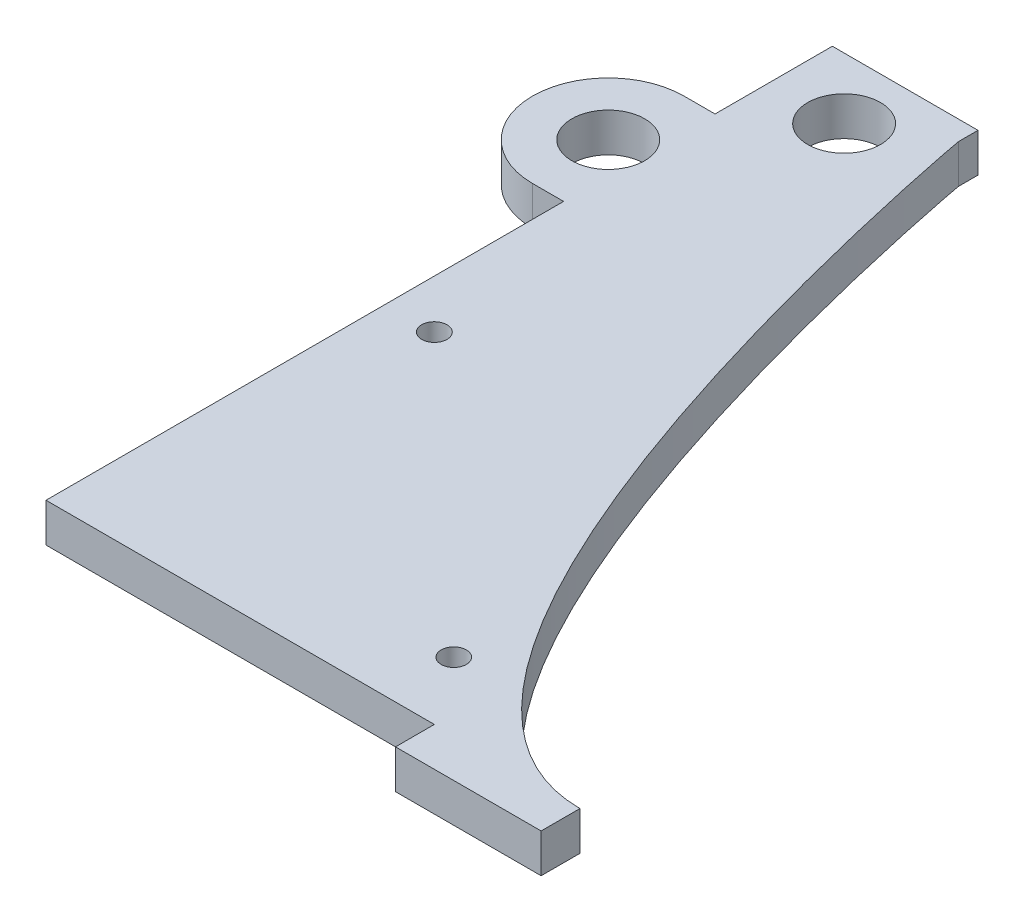
ISO-10303-21;
HEADER;
FILE_DESCRIPTION(('STEP AP214'),'2;1');
FILE_NAME('part.step','',(''),(''),'','','');
FILE_SCHEMA(('AUTOMOTIVE_DESIGN { 1 0 10303 214 1 1 1 1 }'));
ENDSEC;
DATA;
#1=APPLICATION_CONTEXT('core data for automotive mechanical design processes');
#2=APPLICATION_PROTOCOL_DEFINITION('international standard','automotive_design',2000,#1);
#3=PRODUCT_CONTEXT('',#1,'mechanical');
#4=PRODUCT('Part','Part','',(#3));
#5=PRODUCT_RELATED_PRODUCT_CATEGORY('part','',(#4));
#6=PRODUCT_DEFINITION_FORMATION('','',#4);
#7=PRODUCT_DEFINITION_CONTEXT('part definition',#1,'design');
#8=PRODUCT_DEFINITION('design','',#6,#7);
#9=PRODUCT_DEFINITION_SHAPE('','',#8);
#10=(LENGTH_UNIT() NAMED_UNIT(*) SI_UNIT(.MILLI.,.METRE.));
#11=(NAMED_UNIT(*) PLANE_ANGLE_UNIT() SI_UNIT($,.RADIAN.));
#12=(NAMED_UNIT(*) SI_UNIT($,.STERADIAN.) SOLID_ANGLE_UNIT());
#13=UNCERTAINTY_MEASURE_WITH_UNIT(LENGTH_MEASURE(1.E-05),#10,'distance_accuracy_value','');
#14=(GEOMETRIC_REPRESENTATION_CONTEXT(3) GLOBAL_UNCERTAINTY_ASSIGNED_CONTEXT((#13)) GLOBAL_UNIT_ASSIGNED_CONTEXT((#10,
#11,#12)) REPRESENTATION_CONTEXT('',''));
#15=CARTESIAN_POINT('',(0.,0.,0.));
#16=DIRECTION('',(0.,0.,1.));
#17=DIRECTION('',(1.,0.,0.));
#18=AXIS2_PLACEMENT_3D('',#15,#16,#17);
#19=CARTESIAN_POINT('',(-9.525,5.08,48.8950000000001));
#20=DIRECTION('',(1.,0.,0.));
#21=DIRECTION('',(0.,0.,-1.));
#22=AXIS2_PLACEMENT_3D('',#19,#20,#21);
#23=PLANE('',#22);
#24=DIRECTION('',(0.,0.,1.));
#25=VECTOR('',#24,1.);
#26=CARTESIAN_POINT('',(-9.525,5.08,48.8950000000001));
#27=LINE('',#26,#25);
#28=CARTESIAN_POINT('',(-9.52499999999999,5.08,-18.8143243895907));
#29=VERTEX_POINT('',#28);
#30=CARTESIAN_POINT('',(-9.525,5.08,48.8950000000001));
#31=VERTEX_POINT('',#30);
#32=EDGE_CURVE('E59',#29,#31,#27,.T.);
#33=ORIENTED_EDGE('',*,*,#32,.F.);
#34=DIRECTION('',(0.,-1.,0.));
#35=VECTOR('',#34,1.);
#36=CARTESIAN_POINT('',(-9.52499999999999,5.08,-18.8143243895907));
#37=LINE('',#36,#35);
#38=CARTESIAN_POINT('',(-9.52499999999999,0.,-18.8143243895907));
#39=VERTEX_POINT('',#38);
#40=EDGE_CURVE('E180',#29,#39,#37,.T.);
#41=ORIENTED_EDGE('',*,*,#40,.T.);
#42=DIRECTION('',(0.,0.,1.));
#43=VECTOR('',#42,1.);
#44=CARTESIAN_POINT('',(-9.525,0.,48.8950000000001));
#45=LINE('',#44,#43);
#46=CARTESIAN_POINT('',(-9.525,0.,48.8950000000001));
#47=VERTEX_POINT('',#46);
#48=EDGE_CURVE('E354',#39,#47,#45,.T.);
#49=ORIENTED_EDGE('',*,*,#48,.T.);
#50=DIRECTION('',(0.,-1.,0.));
#51=VECTOR('',#50,1.);
#52=CARTESIAN_POINT('',(-9.525,5.08,48.8950000000001));
#53=LINE('',#52,#51);
#54=EDGE_CURVE('E389',#31,#47,#53,.T.);
#55=ORIENTED_EDGE('',*,*,#54,.F.);
#56=EDGE_LOOP('',(#33,#41,#49,#55));
#57=FACE_BOUND('',#56,.T.);
#58=ADVANCED_FACE('F43',(#57),#23,.F.);
#59=CARTESIAN_POINT('',(22.7352910938507,5.08,-1.18732961513015));
#60=DIRECTION('',(0.,-1.,0.));
#61=DIRECTION('',(0.,0.,-1.));
#62=AXIS2_PLACEMENT_3D('',#59,#60,#61);
#63=PLANE('',#62);
#64=DIRECTION('',(-1.,0.,0.));
#65=VECTOR('',#64,1.);
#66=CARTESIAN_POINT('',(-13.589,5.08,-18.8143243895907));
#67=LINE('',#66,#65);
#68=CARTESIAN_POINT('',(-13.589,5.08,-18.8143243895907));
#69=VERTEX_POINT('',#68);
#70=EDGE_CURVE('E145',#29,#69,#67,.T.);
#71=ORIENTED_EDGE('',*,*,#70,.F.);
#72=ORIENTED_EDGE('',*,*,#32,.T.);
#73=DIRECTION('',(1.,0.,0.));
#74=VECTOR('',#73,1.);
#75=CARTESIAN_POINT('',(60.325,5.08,48.8950000000001));
#76=LINE('',#75,#74);
#77=CARTESIAN_POINT('',(41.275,5.08,48.8950000000001));
#78=VERTEX_POINT('',#77);
#79=EDGE_CURVE('E252',#31,#78,#76,.T.);
#80=ORIENTED_EDGE('',*,*,#79,.T.);
#81=DIRECTION('',(0.,0.,1.));
#82=VECTOR('',#81,1.);
#83=CARTESIAN_POINT('',(41.275,5.08,48.8950000000001));
#84=LINE('',#83,#82);
#85=CARTESIAN_POINT('',(41.275,5.08,53.9750000000001));
#86=VERTEX_POINT('',#85);
#87=EDGE_CURVE('E206',#78,#86,#84,.T.);
#88=ORIENTED_EDGE('',*,*,#87,.T.);
#89=DIRECTION('',(1.,0.,0.));
#90=VECTOR('',#89,1.);
#91=CARTESIAN_POINT('',(60.325,5.08,53.9750000000001));
#92=LINE('',#91,#90);
#93=CARTESIAN_POINT('',(60.325,5.08,53.9750000000001));
#94=VERTEX_POINT('',#93);
#95=EDGE_CURVE('E201',#86,#94,#92,.T.);
#96=ORIENTED_EDGE('',*,*,#95,.T.);
#97=DIRECTION('',(0.,0.,-1.));
#98=VECTOR('',#97,1.);
#99=CARTESIAN_POINT('',(60.325,5.08,48.8950000000001));
#100=LINE('',#99,#98);
#101=CARTESIAN_POINT('',(60.325,5.08,48.8950000000001));
#102=VERTEX_POINT('',#101);
#103=EDGE_CURVE('E189',#94,#102,#100,.T.);
#104=ORIENTED_EDGE('',*,*,#103,.T.);
#105=CARTESIAN_POINT('',(60.325,5.08,48.895));
#106=CARTESIAN_POINT('',(27.8191095836019,5.08,48.895));
#107=CARTESIAN_POINT('',(9.525,5.08,-51.214545640347));
#108=CARTESIAN_POINT('',(9.525,5.08,-51.435));
#109=B_SPLINE_CURVE_WITH_KNOTS('',3,(#105,#106,#107,#108),.UNSPECIFIED.,.F.,.F.,(4,4),(0.,1.),.UNSPECIFIED.);
#110=CARTESIAN_POINT('',(9.525,5.08,-51.435));
#111=VERTEX_POINT('',#110);
#112=EDGE_CURVE('E256',#102,#111,#109,.T.);
#113=ORIENTED_EDGE('',*,*,#112,.T.);
#114=DIRECTION('',(0.,0.,-1.));
#115=VECTOR('',#114,1.);
#116=CARTESIAN_POINT('',(9.525,5.08,-51.435));
#117=LINE('',#116,#115);
#118=CARTESIAN_POINT('',(9.52499999999999,5.08,-53.9749999999999));
#119=VERTEX_POINT('',#118);
#120=EDGE_CURVE('E242',#111,#119,#117,.T.);
#121=ORIENTED_EDGE('',*,*,#120,.T.);
#122=DIRECTION('',(-1.,0.,0.));
#123=VECTOR('',#122,1.);
#124=CARTESIAN_POINT('',(-9.52499999999998,5.08,-53.9749999999999));
#125=LINE('',#124,#123);
#126=CARTESIAN_POINT('',(-9.52499999999998,5.08,-53.9749999999999));
#127=VERTEX_POINT('',#126);
#128=EDGE_CURVE('E246',#119,#127,#125,.T.);
#129=ORIENTED_EDGE('',*,*,#128,.T.);
#130=CARTESIAN_POINT('',(-9.52499999999999,5.08,-38.6263243895907));
#131=VERTEX_POINT('',#130);
#132=EDGE_CURVE('E154',#127,#131,#27,.T.);
#133=ORIENTED_EDGE('',*,*,#132,.T.);
#134=DIRECTION('',(1.,0.,0.));
#135=VECTOR('',#134,1.);
#136=CARTESIAN_POINT('',(-13.589,5.08,-38.6263243895907));
#137=LINE('',#136,#135);
#138=CARTESIAN_POINT('',(-13.589,5.08,-38.6263243895907));
#139=VERTEX_POINT('',#138);
#140=EDGE_CURVE('E137',#139,#131,#137,.T.);
#141=ORIENTED_EDGE('',*,*,#140,.F.);
#142=CARTESIAN_POINT('',(-13.589,5.08,-28.7203243895907));
#143=DIRECTION('',(0.,-1.,0.));
#144=DIRECTION('',(0.,0.,-1.));
#145=AXIS2_PLACEMENT_3D('',#142,#143,#144);
#146=CIRCLE('',#145,9.906);
#147=EDGE_CURVE('E152',#69,#139,#146,.T.);
#148=ORIENTED_EDGE('',*,*,#147,.F.);
#149=EDGE_LOOP('',(#71,#72,#80,#88,#96,#104,#113,#121,#129,#133,#141,#148));
#150=FACE_BOUND('',#149,.T.);
#151=CARTESIAN_POINT('',(34.925,5.08,40.0050000000001));
#152=DIRECTION('',(0.,-1.,0.));
#153=DIRECTION('',(0.,0.,-1.));
#154=AXIS2_PLACEMENT_3D('',#151,#152,#153);
#155=CIRCLE('',#154,1.651);
#156=CARTESIAN_POINT('',(34.925,5.08,38.3540000000001));
#157=VERTEX_POINT('',#156);
#158=EDGE_CURVE('E185',#157,#157,#155,.T.);
#159=ORIENTED_EDGE('',*,*,#158,.T.);
#160=EDGE_LOOP('',(#159));
#161=FACE_BOUND('',#160,.T.);
#162=CARTESIAN_POINT('',(-3.17499999999998,5.08,4.44500000000005));
#163=DIRECTION('',(0.,-1.,0.));
#164=DIRECTION('',(0.,0.,-1.));
#165=AXIS2_PLACEMENT_3D('',#162,#163,#164);
#166=CIRCLE('',#165,1.66072838208594);
#167=CARTESIAN_POINT('',(-3.17499999999998,5.08,2.78427161791411));
#168=VERTEX_POINT('',#167);
#169=EDGE_CURVE('E179',#168,#168,#166,.T.);
#170=ORIENTED_EDGE('',*,*,#169,.T.);
#171=EDGE_LOOP('',(#170));
#172=FACE_BOUND('',#171,.T.);
#173=CARTESIAN_POINT('',(-13.589,5.08,-28.7203243895907));
#174=DIRECTION('',(0.,-1.,0.));
#175=DIRECTION('',(0.,0.,-1.));
#176=AXIS2_PLACEMENT_3D('',#173,#174,#175);
#177=CIRCLE('',#176,4.7625);
#178=CARTESIAN_POINT('',(-13.589,5.08,-33.4828243895907));
#179=VERTEX_POINT('',#178);
#180=EDGE_CURVE('E174',#179,#179,#177,.T.);
#181=ORIENTED_EDGE('',*,*,#180,.T.);
#182=EDGE_LOOP('',(#181));
#183=FACE_BOUND('',#182,.T.);
#184=CARTESIAN_POINT('',(0.,5.08,-45.9866999999999));
#185=DIRECTION('',(0.,1.,0.));
#186=DIRECTION('',(0.,0.,1.));
#187=AXIS2_PLACEMENT_3D('',#184,#185,#186);
#188=CIRCLE('',#187,4.7625);
#189=CARTESIAN_POINT('',(0.,5.08,-41.2241999999999));
#190=VERTEX_POINT('',#189);
#191=EDGE_CURVE('E234',#190,#190,#188,.T.);
#192=ORIENTED_EDGE('',*,*,#191,.F.);
#193=EDGE_LOOP('',(#192));
#194=FACE_BOUND('',#193,.T.);
#195=ADVANCED_FACE('F150',(#150,#161,#172,#183,#194),#63,.F.);
#196=CARTESIAN_POINT('',(22.7352910938507,0.,-1.18732961513015));
#197=DIRECTION('',(0.,-1.,0.));
#198=DIRECTION('',(0.,0.,-1.));
#199=AXIS2_PLACEMENT_3D('',#196,#197,#198);
#200=PLANE('',#199);
#201=CARTESIAN_POINT('',(-13.589,0.,-28.7203243895907));
#202=DIRECTION('',(0.,-1.,0.));
#203=DIRECTION('',(0.,0.,-1.));
#204=AXIS2_PLACEMENT_3D('',#201,#202,#203);
#205=CIRCLE('',#204,4.7625);
#206=CARTESIAN_POINT('',(-13.589,0.,-33.4828243895907));
#207=VERTEX_POINT('',#206);
#208=EDGE_CURVE('E166',#207,#207,#205,.T.);
#209=ORIENTED_EDGE('',*,*,#208,.F.);
#210=EDGE_LOOP('',(#209));
#211=FACE_BOUND('',#210,.T.);
#212=ORIENTED_EDGE('',*,*,#48,.F.);
#213=DIRECTION('',(-1.,0.,0.));
#214=VECTOR('',#213,1.);
#215=CARTESIAN_POINT('',(-13.589,0.,-18.8143243895907));
#216=LINE('',#215,#214);
#217=CARTESIAN_POINT('',(-13.589,0.,-18.8143243895907));
#218=VERTEX_POINT('',#217);
#219=EDGE_CURVE('E160',#39,#218,#216,.T.);
#220=ORIENTED_EDGE('',*,*,#219,.T.);
#221=CARTESIAN_POINT('',(-13.589,0.,-28.7203243895907));
#222=DIRECTION('',(0.,-1.,0.));
#223=DIRECTION('',(0.,0.,-1.));
#224=AXIS2_PLACEMENT_3D('',#221,#222,#223);
#225=CIRCLE('',#224,9.906);
#226=CARTESIAN_POINT('',(-13.589,0.,-38.6263243895907));
#227=VERTEX_POINT('',#226);
#228=EDGE_CURVE('E171',#218,#227,#225,.T.);
#229=ORIENTED_EDGE('',*,*,#228,.T.);
#230=DIRECTION('',(1.,0.,0.));
#231=VECTOR('',#230,1.);
#232=CARTESIAN_POINT('',(-13.589,0.,-38.6263243895907));
#233=LINE('',#232,#231);
#234=CARTESIAN_POINT('',(-9.52499999999999,0.,-38.6263243895907));
#235=VERTEX_POINT('',#234);
#236=EDGE_CURVE('E139',#227,#235,#233,.T.);
#237=ORIENTED_EDGE('',*,*,#236,.T.);
#238=CARTESIAN_POINT('',(-9.52499999999998,0.,-53.9749999999999));
#239=VERTEX_POINT('',#238);
#240=EDGE_CURVE('E365',#239,#235,#45,.T.);
#241=ORIENTED_EDGE('',*,*,#240,.F.);
#242=DIRECTION('',(-1.,0.,0.));
#243=VECTOR('',#242,1.);
#244=CARTESIAN_POINT('',(-9.52499999999998,0.,-53.9749999999999));
#245=LINE('',#244,#243);
#246=CARTESIAN_POINT('',(9.52499999999999,0.,-53.9749999999999));
#247=VERTEX_POINT('',#246);
#248=EDGE_CURVE('E366',#247,#239,#245,.T.);
#249=ORIENTED_EDGE('',*,*,#248,.F.);
#250=DIRECTION('',(0.,0.,-1.));
#251=VECTOR('',#250,1.);
#252=CARTESIAN_POINT('',(9.525,0.,-51.435));
#253=LINE('',#252,#251);
#254=CARTESIAN_POINT('',(9.525,0.,-51.435));
#255=VERTEX_POINT('',#254);
#256=EDGE_CURVE('E238',#255,#247,#253,.T.);
#257=ORIENTED_EDGE('',*,*,#256,.F.);
#258=CARTESIAN_POINT('',(60.325,0.,48.895));
#259=CARTESIAN_POINT('',(27.8191095836019,0.,48.895));
#260=CARTESIAN_POINT('',(9.525,0.,-51.214545640347));
#261=CARTESIAN_POINT('',(9.525,0.,-51.435));
#262=B_SPLINE_CURVE_WITH_KNOTS('',3,(#258,#259,#260,#261),.UNSPECIFIED.,.F.,.F.,(4,4),(0.,1.),.UNSPECIFIED.);
#263=CARTESIAN_POINT('',(60.325,0.,48.8950000000001));
#264=VERTEX_POINT('',#263);
#265=EDGE_CURVE('E247',#264,#255,#262,.T.);
#266=ORIENTED_EDGE('',*,*,#265,.F.);
#267=DIRECTION('',(0.,0.,-1.));
#268=VECTOR('',#267,1.);
#269=CARTESIAN_POINT('',(60.325,0.,48.8950000000001));
#270=LINE('',#269,#268);
#271=CARTESIAN_POINT('',(60.325,0.,53.9750000000001));
#272=VERTEX_POINT('',#271);
#273=EDGE_CURVE('E213',#272,#264,#270,.T.);
#274=ORIENTED_EDGE('',*,*,#273,.F.);
#275=DIRECTION('',(1.,0.,0.));
#276=VECTOR('',#275,1.);
#277=CARTESIAN_POINT('',(60.325,0.,53.9750000000001));
#278=LINE('',#277,#276);
#279=CARTESIAN_POINT('',(41.275,0.,53.9750000000001));
#280=VERTEX_POINT('',#279);
#281=EDGE_CURVE('E218',#280,#272,#278,.T.);
#282=ORIENTED_EDGE('',*,*,#281,.F.);
#283=DIRECTION('',(0.,0.,1.));
#284=VECTOR('',#283,1.);
#285=CARTESIAN_POINT('',(41.275,0.,48.8950000000001));
#286=LINE('',#285,#284);
#287=CARTESIAN_POINT('',(41.275,0.,48.8950000000001));
#288=VERTEX_POINT('',#287);
#289=EDGE_CURVE('E223',#288,#280,#286,.T.);
#290=ORIENTED_EDGE('',*,*,#289,.F.);
#291=DIRECTION('',(1.,0.,0.));
#292=VECTOR('',#291,1.);
#293=CARTESIAN_POINT('',(60.325,0.,48.8950000000001));
#294=LINE('',#293,#292);
#295=EDGE_CURVE('E362',#47,#288,#294,.T.);
#296=ORIENTED_EDGE('',*,*,#295,.F.);
#297=EDGE_LOOP('',(#212,#220,#229,#237,#241,#249,#257,#266,#274,#282,#290,#296));
#298=FACE_BOUND('',#297,.T.);
#299=CARTESIAN_POINT('',(34.925,0.,40.0050000000001));
#300=DIRECTION('',(0.,-1.,0.));
#301=DIRECTION('',(0.,0.,-1.));
#302=AXIS2_PLACEMENT_3D('',#299,#300,#301);
#303=CIRCLE('',#302,1.651);
#304=CARTESIAN_POINT('',(34.925,0.,38.3540000000001));
#305=VERTEX_POINT('',#304);
#306=EDGE_CURVE('E190',#305,#305,#303,.T.);
#307=ORIENTED_EDGE('',*,*,#306,.F.);
#308=EDGE_LOOP('',(#307));
#309=FACE_BOUND('',#308,.T.);
#310=CARTESIAN_POINT('',(-3.17499999999998,0.,4.44500000000005));
#311=DIRECTION('',(0.,-1.,0.));
#312=DIRECTION('',(0.,0.,-1.));
#313=AXIS2_PLACEMENT_3D('',#310,#311,#312);
#314=CIRCLE('',#313,1.66072838208594);
#315=CARTESIAN_POINT('',(-3.17499999999998,0.,2.78427161791411));
#316=VERTEX_POINT('',#315);
#317=EDGE_CURVE('E194',#316,#316,#314,.T.);
#318=ORIENTED_EDGE('',*,*,#317,.F.);
#319=EDGE_LOOP('',(#318));
#320=FACE_BOUND('',#319,.T.);
#321=CARTESIAN_POINT('',(0.,0.,-45.9866999999999));
#322=DIRECTION('',(0.,1.,0.));
#323=DIRECTION('',(0.,0.,1.));
#324=AXIS2_PLACEMENT_3D('',#321,#322,#323);
#325=CIRCLE('',#324,4.7625);
#326=CARTESIAN_POINT('',(0.,0.,-41.2241999999999));
#327=VERTEX_POINT('',#326);
#328=EDGE_CURVE('E216',#327,#327,#325,.T.);
#329=ORIENTED_EDGE('',*,*,#328,.T.);
#330=EDGE_LOOP('',(#329));
#331=FACE_BOUND('',#330,.T.);
#332=ADVANCED_FACE('F275',(#211,#298,#309,#320,#331),#200,.T.);
#333=CARTESIAN_POINT('',(9.525,5.08,-51.435));
#334=DIRECTION('',(-1.,0.,0.));
#335=DIRECTION('',(0.,0.,1.));
#336=AXIS2_PLACEMENT_3D('',#333,#334,#335);
#337=PLANE('',#336);
#338=ORIENTED_EDGE('',*,*,#256,.T.);
#339=DIRECTION('',(0.,-1.,0.));
#340=VECTOR('',#339,1.);
#341=CARTESIAN_POINT('',(9.52499999999999,5.08,-53.9749999999999));
#342=LINE('',#341,#340);
#343=EDGE_CURVE('E11',#119,#247,#342,.T.);
#344=ORIENTED_EDGE('',*,*,#343,.F.);
#345=ORIENTED_EDGE('',*,*,#120,.F.);
#346=DIRECTION('',(0.,-1.,0.));
#347=VECTOR('',#346,1.);
#348=CARTESIAN_POINT('',(9.525,5.08,-51.435));
#349=LINE('',#348,#347);
#350=EDGE_CURVE('E262',#111,#255,#349,.T.);
#351=ORIENTED_EDGE('',*,*,#350,.T.);
#352=EDGE_LOOP('',(#338,#344,#345,#351));
#353=FACE_BOUND('',#352,.T.);
#354=ADVANCED_FACE('F45',(#353),#337,.F.);
#355=CARTESIAN_POINT('',(-9.52499999999998,5.08,-53.9749999999999));
#356=DIRECTION('',(0.,0.,1.));
#357=DIRECTION('',(1.,0.,0.));
#358=AXIS2_PLACEMENT_3D('',#355,#356,#357);
#359=PLANE('',#358);
#360=ORIENTED_EDGE('',*,*,#248,.T.);
#361=DIRECTION('',(0.,-1.,0.));
#362=VECTOR('',#361,1.);
#363=CARTESIAN_POINT('',(-9.52499999999998,5.08,-53.9749999999999));
#364=LINE('',#363,#362);
#365=EDGE_CURVE('E52',#127,#239,#364,.T.);
#366=ORIENTED_EDGE('',*,*,#365,.F.);
#367=ORIENTED_EDGE('',*,*,#128,.F.);
#368=ORIENTED_EDGE('',*,*,#343,.T.);
#369=EDGE_LOOP('',(#360,#366,#367,#368));
#370=FACE_BOUND('',#369,.T.);
#371=ADVANCED_FACE('F282',(#370),#359,.F.);
#372=ORIENTED_EDGE('',*,*,#240,.T.);
#373=DIRECTION('',(0.,-1.,0.));
#374=VECTOR('',#373,1.);
#375=CARTESIAN_POINT('',(-9.52499999999999,5.08,-38.6263243895907));
#376=LINE('',#375,#374);
#377=EDGE_CURVE('E67',#131,#235,#376,.T.);
#378=ORIENTED_EDGE('',*,*,#377,.F.);
#379=ORIENTED_EDGE('',*,*,#132,.F.);
#380=ORIENTED_EDGE('',*,*,#365,.T.);
#381=EDGE_LOOP('',(#372,#378,#379,#380));
#382=FACE_BOUND('',#381,.T.);
#383=ADVANCED_FACE('F279',(#382),#23,.F.);
#384=CARTESIAN_POINT('',(60.325,5.08,48.8950000000001));
#385=DIRECTION('',(0.,0.,-1.));
#386=DIRECTION('',(-1.,0.,0.));
#387=AXIS2_PLACEMENT_3D('',#384,#385,#386);
#388=PLANE('',#387);
#389=ORIENTED_EDGE('',*,*,#295,.T.);
#390=DIRECTION('',(0.,1.,0.));
#391=VECTOR('',#390,1.);
#392=CARTESIAN_POINT('',(41.275,-19.7157018642502,48.8950000000001));
#393=LINE('',#392,#391);
#394=EDGE_CURVE('E205',#288,#78,#393,.T.);
#395=ORIENTED_EDGE('',*,*,#394,.T.);
#396=ORIENTED_EDGE('',*,*,#79,.F.);
#397=ORIENTED_EDGE('',*,*,#54,.T.);
#398=EDGE_LOOP('',(#389,#395,#396,#397));
#399=FACE_BOUND('',#398,.T.);
#400=ADVANCED_FACE('F273',(#399),#388,.F.);
#401=DIRECTION('',(0.,-1.,0.));
#402=VECTOR('',#401,1.);
#403=SURFACE_OF_LINEAR_EXTRUSION('',#109,#402);
#404=ORIENTED_EDGE('',*,*,#265,.T.);
#405=ORIENTED_EDGE('',*,*,#350,.F.);
#406=ORIENTED_EDGE('',*,*,#112,.F.);
#407=DIRECTION('',(0.,-1.,0.));
#408=VECTOR('',#407,1.);
#409=CARTESIAN_POINT('',(60.325,5.08,48.8950000000001));
#410=LINE('',#409,#408);
#411=EDGE_CURVE('E385',#102,#264,#410,.T.);
#412=ORIENTED_EDGE('',*,*,#411,.T.);
#413=EDGE_LOOP('',(#404,#405,#406,#412));
#414=FACE_BOUND('',#413,.T.);
#415=ADVANCED_FACE('F268',(#414),#403,.F.);
#416=CARTESIAN_POINT('',(0.,5.08,-45.9866999999999));
#417=DIRECTION('',(0.,-1.,0.));
#418=DIRECTION('',(0.,0.,-1.));
#419=AXIS2_PLACEMENT_3D('',#416,#417,#418);
#420=CYLINDRICAL_SURFACE('',#419,4.7625);
#421=ORIENTED_EDGE('',*,*,#191,.T.);
#422=EDGE_LOOP('',(#421));
#423=FACE_BOUND('',#422,.T.);
#424=ORIENTED_EDGE('',*,*,#328,.F.);
#425=EDGE_LOOP('',(#424));
#426=FACE_BOUND('',#425,.T.);
#427=ADVANCED_FACE('F272',(#423,#426),#420,.F.);
#428=CARTESIAN_POINT('',(41.275,-19.7157018642502,48.8950000000001));
#429=DIRECTION('',(-1.,0.,0.));
#430=DIRECTION('',(0.,0.,1.));
#431=AXIS2_PLACEMENT_3D('',#428,#429,#430);
#432=PLANE('',#431);
#433=ORIENTED_EDGE('',*,*,#394,.F.);
#434=ORIENTED_EDGE('',*,*,#289,.T.);
#435=DIRECTION('',(0.,1.,0.));
#436=VECTOR('',#435,1.);
#437=CARTESIAN_POINT('',(41.275,-19.7157018642502,53.9750000000001));
#438=LINE('',#437,#436);
#439=EDGE_CURVE('E222',#280,#86,#438,.T.);
#440=ORIENTED_EDGE('',*,*,#439,.T.);
#441=ORIENTED_EDGE('',*,*,#87,.F.);
#442=EDGE_LOOP('',(#433,#434,#440,#441));
#443=FACE_BOUND('',#442,.T.);
#444=ADVANCED_FACE('F303',(#443),#432,.T.);
#445=CARTESIAN_POINT('',(60.325,-19.7157018642502,53.9750000000001));
#446=DIRECTION('',(0.,0.,1.));
#447=DIRECTION('',(1.,0.,0.));
#448=AXIS2_PLACEMENT_3D('',#445,#446,#447);
#449=PLANE('',#448);
#450=ORIENTED_EDGE('',*,*,#439,.F.);
#451=ORIENTED_EDGE('',*,*,#281,.T.);
#452=DIRECTION('',(0.,1.,0.));
#453=VECTOR('',#452,1.);
#454=CARTESIAN_POINT('',(60.325,-19.7157018642502,53.9750000000001));
#455=LINE('',#454,#453);
#456=EDGE_CURVE('E217',#272,#94,#455,.T.);
#457=ORIENTED_EDGE('',*,*,#456,.T.);
#458=ORIENTED_EDGE('',*,*,#95,.F.);
#459=EDGE_LOOP('',(#450,#451,#457,#458));
#460=FACE_BOUND('',#459,.T.);
#461=ADVANCED_FACE('F307',(#460),#449,.T.);
#462=CARTESIAN_POINT('',(60.325,-19.7157018642502,48.8950000000001));
#463=DIRECTION('',(1.,0.,0.));
#464=DIRECTION('',(0.,0.,-1.));
#465=AXIS2_PLACEMENT_3D('',#462,#463,#464);
#466=PLANE('',#465);
#467=ORIENTED_EDGE('',*,*,#456,.F.);
#468=ORIENTED_EDGE('',*,*,#273,.T.);
#469=ORIENTED_EDGE('',*,*,#411,.F.);
#470=ORIENTED_EDGE('',*,*,#103,.F.);
#471=EDGE_LOOP('',(#467,#468,#469,#470));
#472=FACE_BOUND('',#471,.T.);
#473=ADVANCED_FACE('F311',(#472),#466,.T.);
#474=CARTESIAN_POINT('',(-3.17499999999998,5.08,4.44500000000005));
#475=DIRECTION('',(0.,-1.,0.));
#476=DIRECTION('',(0.,0.,-1.));
#477=AXIS2_PLACEMENT_3D('',#474,#475,#476);
#478=CYLINDRICAL_SURFACE('',#477,1.66072838208594);
#479=ORIENTED_EDGE('',*,*,#169,.F.);
#480=EDGE_LOOP('',(#479));
#481=FACE_BOUND('',#480,.T.);
#482=ORIENTED_EDGE('',*,*,#317,.T.);
#483=EDGE_LOOP('',(#482));
#484=FACE_BOUND('',#483,.T.);
#485=ADVANCED_FACE('F315',(#481,#484),#478,.F.);
#486=CARTESIAN_POINT('',(34.925,5.08,40.0050000000001));
#487=DIRECTION('',(0.,-1.,0.));
#488=DIRECTION('',(0.,0.,-1.));
#489=AXIS2_PLACEMENT_3D('',#486,#487,#488);
#490=CYLINDRICAL_SURFACE('',#489,1.651);
#491=ORIENTED_EDGE('',*,*,#158,.F.);
#492=EDGE_LOOP('',(#491));
#493=FACE_BOUND('',#492,.T.);
#494=ORIENTED_EDGE('',*,*,#306,.T.);
#495=EDGE_LOOP('',(#494));
#496=FACE_BOUND('',#495,.T.);
#497=ADVANCED_FACE('F319',(#493,#496),#490,.F.);
#498=CARTESIAN_POINT('',(-13.589,5.08,-28.7203243895907));
#499=DIRECTION('',(0.,-1.,0.));
#500=DIRECTION('',(0.,0.,-1.));
#501=AXIS2_PLACEMENT_3D('',#498,#499,#500);
#502=CYLINDRICAL_SURFACE('',#501,4.7625);
#503=ORIENTED_EDGE('',*,*,#180,.F.);
#504=EDGE_LOOP('',(#503));
#505=FACE_BOUND('',#504,.T.);
#506=ORIENTED_EDGE('',*,*,#208,.T.);
#507=EDGE_LOOP('',(#506));
#508=FACE_BOUND('',#507,.T.);
#509=ADVANCED_FACE('F323',(#505,#508),#502,.F.);
#510=CARTESIAN_POINT('',(-13.589,5.08,-28.7203243895907));
#511=DIRECTION('',(0.,-1.,0.));
#512=DIRECTION('',(0.,0.,-1.));
#513=AXIS2_PLACEMENT_3D('',#510,#511,#512);
#514=CYLINDRICAL_SURFACE('',#513,9.906);
#515=ORIENTED_EDGE('',*,*,#228,.F.);
#516=DIRECTION('',(0.,-1.,0.));
#517=VECTOR('',#516,1.);
#518=CARTESIAN_POINT('',(-13.589,5.08,-18.8143243895907));
#519=LINE('',#518,#517);
#520=EDGE_CURVE('E158',#69,#218,#519,.T.);
#521=ORIENTED_EDGE('',*,*,#520,.F.);
#522=ORIENTED_EDGE('',*,*,#147,.T.);
#523=DIRECTION('',(0.,-1.,0.));
#524=VECTOR('',#523,1.);
#525=CARTESIAN_POINT('',(-13.589,5.08,-38.6263243895907));
#526=LINE('',#525,#524);
#527=EDGE_CURVE('E134',#139,#227,#526,.T.);
#528=ORIENTED_EDGE('',*,*,#527,.T.);
#529=EDGE_LOOP('',(#515,#521,#522,#528));
#530=FACE_BOUND('',#529,.T.);
#531=ADVANCED_FACE('F157',(#530),#514,.T.);
#532=CARTESIAN_POINT('',(-13.589,5.08,-18.8143243895907));
#533=DIRECTION('',(0.,0.,1.));
#534=DIRECTION('',(1.,0.,0.));
#535=AXIS2_PLACEMENT_3D('',#532,#533,#534);
#536=PLANE('',#535);
#537=ORIENTED_EDGE('',*,*,#219,.F.);
#538=ORIENTED_EDGE('',*,*,#40,.F.);
#539=ORIENTED_EDGE('',*,*,#70,.T.);
#540=ORIENTED_EDGE('',*,*,#520,.T.);
#541=EDGE_LOOP('',(#537,#538,#539,#540));
#542=FACE_BOUND('',#541,.T.);
#543=ADVANCED_FACE('F327',(#542),#536,.T.);
#544=CARTESIAN_POINT('',(-13.589,5.08,-38.6263243895907));
#545=DIRECTION('',(0.,0.,-1.));
#546=DIRECTION('',(-1.,0.,0.));
#547=AXIS2_PLACEMENT_3D('',#544,#545,#546);
#548=PLANE('',#547);
#549=ORIENTED_EDGE('',*,*,#236,.F.);
#550=ORIENTED_EDGE('',*,*,#527,.F.);
#551=ORIENTED_EDGE('',*,*,#140,.T.);
#552=ORIENTED_EDGE('',*,*,#377,.T.);
#553=EDGE_LOOP('',(#549,#550,#551,#552));
#554=FACE_BOUND('',#553,.T.);
#555=ADVANCED_FACE('F136',(#554),#548,.T.);
#556=CLOSED_SHELL('',(#58,#195,#332,#354,#371,#383,#400,#415,#427,#444,#461,#473,#485,#497,#509,
#531,#543,#555));
#557=MANIFOLD_SOLID_BREP('B2',#556);
#558=ADVANCED_BREP_SHAPE_REPRESENTATION('',(#18,#557),#14);
#559=SHAPE_DEFINITION_REPRESENTATION(#9,#558);
ENDSEC;
END-ISO-10303-21;
